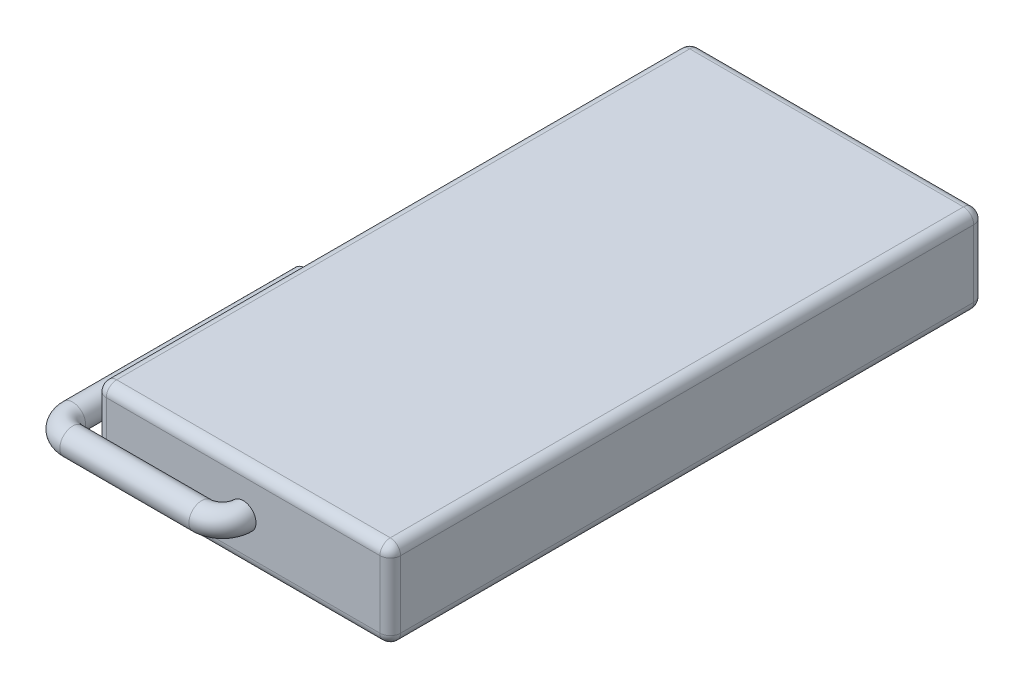
ISO-10303-21;
HEADER;
FILE_DESCRIPTION(('STEP AP214'),'2;1');
FILE_NAME('part.step','',(''),(''),'','','');
FILE_SCHEMA(('AUTOMOTIVE_DESIGN { 1 0 10303 214 1 1 1 1 }'));
ENDSEC;
DATA;
#1=APPLICATION_CONTEXT('core data for automotive mechanical design processes');
#2=APPLICATION_PROTOCOL_DEFINITION('international standard','automotive_design',2000,#1);
#3=PRODUCT_CONTEXT('',#1,'mechanical');
#4=PRODUCT('Part','Part','',(#3));
#5=PRODUCT_RELATED_PRODUCT_CATEGORY('part','',(#4));
#6=PRODUCT_DEFINITION_FORMATION('','',#4);
#7=PRODUCT_DEFINITION_CONTEXT('part definition',#1,'design');
#8=PRODUCT_DEFINITION('design','',#6,#7);
#9=PRODUCT_DEFINITION_SHAPE('','',#8);
#10=(LENGTH_UNIT() NAMED_UNIT(*) SI_UNIT(.MILLI.,.METRE.));
#11=(NAMED_UNIT(*) PLANE_ANGLE_UNIT() SI_UNIT($,.RADIAN.));
#12=(NAMED_UNIT(*) SI_UNIT($,.STERADIAN.) SOLID_ANGLE_UNIT());
#13=UNCERTAINTY_MEASURE_WITH_UNIT(LENGTH_MEASURE(1.E-05),#10,'distance_accuracy_value','');
#14=(GEOMETRIC_REPRESENTATION_CONTEXT(3) GLOBAL_UNCERTAINTY_ASSIGNED_CONTEXT((#13)) GLOBAL_UNIT_ASSIGNED_CONTEXT((#10,
#11,#12)) REPRESENTATION_CONTEXT('',''));
#15=CARTESIAN_POINT('',(0.,0.,0.));
#16=DIRECTION('',(0.,0.,1.));
#17=DIRECTION('',(1.,0.,0.));
#18=AXIS2_PLACEMENT_3D('',#15,#16,#17);
#19=CARTESIAN_POINT('',(-28.5,8.5,57.5));
#20=DIRECTION('',(1.,0.,0.));
#21=DIRECTION('',(0.,0.,-1.));
#22=AXIS2_PLACEMENT_3D('',#19,#20,#21);
#23=PLANE('',#22);
#24=DIRECTION('',(0.,0.,1.));
#25=VECTOR('',#24,1.);
#26=CARTESIAN_POINT('',(-28.5,6.5,-57.5));
#27=LINE('',#26,#25);
#28=CARTESIAN_POINT('',(-28.5,6.5,55.5));
#29=VERTEX_POINT('',#28);
#30=CARTESIAN_POINT('',(-28.5,6.5,-55.5));
#31=VERTEX_POINT('',#30);
#32=EDGE_CURVE('E199',#29,#31,#27,.F.);
#33=ORIENTED_EDGE('',*,*,#32,.T.);
#34=DIRECTION('',(0.,-1.,0.));
#35=VECTOR('',#34,1.);
#36=CARTESIAN_POINT('',(-28.5,8.5,-55.5));
#37=LINE('',#36,#35);
#38=CARTESIAN_POINT('',(-28.5,-6.5,-55.5));
#39=VERTEX_POINT('',#38);
#40=EDGE_CURVE('E201',#31,#39,#37,.T.);
#41=ORIENTED_EDGE('',*,*,#40,.T.);
#42=DIRECTION('',(0.,0.,1.));
#43=VECTOR('',#42,1.);
#44=CARTESIAN_POINT('',(-28.5,-6.5,57.5));
#45=LINE('',#44,#43);
#46=CARTESIAN_POINT('',(-28.5,-6.5,55.5));
#47=VERTEX_POINT('',#46);
#48=EDGE_CURVE('E197',#39,#47,#45,.T.);
#49=ORIENTED_EDGE('',*,*,#48,.T.);
#50=DIRECTION('',(0.,-1.,0.));
#51=VECTOR('',#50,1.);
#52=CARTESIAN_POINT('',(-28.5,8.5,55.5));
#53=LINE('',#52,#51);
#54=EDGE_CURVE('E195',#47,#29,#53,.F.);
#55=ORIENTED_EDGE('',*,*,#54,.T.);
#56=EDGE_LOOP('',(#33,#41,#49,#55));
#57=FACE_BOUND('',#56,.T.);
#58=ADVANCED_FACE('F34',(#57),#23,.F.);
#59=CARTESIAN_POINT('',(28.5,8.5,57.5));
#60=DIRECTION('',(0.,0.,-1.));
#61=DIRECTION('',(-1.,0.,0.));
#62=AXIS2_PLACEMENT_3D('',#59,#60,#61);
#63=PLANE('',#62);
#64=CARTESIAN_POINT('',(0.,0.,57.5));
#65=DIRECTION('',(0.,0.,1.));
#66=DIRECTION('',(1.,0.,0.));
#67=AXIS2_PLACEMENT_3D('',#64,#65,#66);
#68=CIRCLE('',#67,2.5);
#69=CARTESIAN_POINT('',(2.5,0.,57.5));
#70=VERTEX_POINT('',#69);
#71=EDGE_CURVE('E11',#70,#70,#68,.T.);
#72=ORIENTED_EDGE('',*,*,#71,.F.);
#73=EDGE_LOOP('',(#72));
#74=FACE_BOUND('',#73,.T.);
#75=DIRECTION('',(1.,0.,0.));
#76=VECTOR('',#75,1.);
#77=CARTESIAN_POINT('',(-28.5,6.5,57.5));
#78=LINE('',#77,#76);
#79=CARTESIAN_POINT('',(26.5,6.5,57.5));
#80=VERTEX_POINT('',#79);
#81=CARTESIAN_POINT('',(-26.5,6.5,57.5));
#82=VERTEX_POINT('',#81);
#83=EDGE_CURVE('E51',#80,#82,#78,.F.);
#84=ORIENTED_EDGE('',*,*,#83,.T.);
#85=DIRECTION('',(0.,-1.,0.));
#86=VECTOR('',#85,1.);
#87=CARTESIAN_POINT('',(-26.5,8.5,57.5));
#88=LINE('',#87,#86);
#89=CARTESIAN_POINT('',(-26.5,-6.5,57.5));
#90=VERTEX_POINT('',#89);
#91=EDGE_CURVE('E43',#82,#90,#88,.T.);
#92=ORIENTED_EDGE('',*,*,#91,.T.);
#93=DIRECTION('',(1.,0.,0.));
#94=VECTOR('',#93,1.);
#95=CARTESIAN_POINT('',(28.5,-6.5,57.5));
#96=LINE('',#95,#94);
#97=CARTESIAN_POINT('',(26.5,-6.5,57.5));
#98=VERTEX_POINT('',#97);
#99=EDGE_CURVE('E204',#90,#98,#96,.T.);
#100=ORIENTED_EDGE('',*,*,#99,.T.);
#101=DIRECTION('',(0.,-1.,0.));
#102=VECTOR('',#101,1.);
#103=CARTESIAN_POINT('',(26.5,8.5,57.5));
#104=LINE('',#103,#102);
#105=EDGE_CURVE('E56',#98,#80,#104,.F.);
#106=ORIENTED_EDGE('',*,*,#105,.T.);
#107=EDGE_LOOP('',(#84,#92,#100,#106));
#108=FACE_BOUND('',#107,.T.);
#109=ADVANCED_FACE('F292',(#74,#108),#63,.F.);
#110=CARTESIAN_POINT('',(28.5,8.5,57.5));
#111=DIRECTION('',(-1.,0.,0.));
#112=DIRECTION('',(0.,0.,1.));
#113=AXIS2_PLACEMENT_3D('',#110,#111,#112);
#114=PLANE('',#113);
#115=DIRECTION('',(0.,0.,-1.));
#116=VECTOR('',#115,1.);
#117=CARTESIAN_POINT('',(28.5,-6.5,57.5));
#118=LINE('',#117,#116);
#119=CARTESIAN_POINT('',(28.5,-6.5,55.5));
#120=VERTEX_POINT('',#119);
#121=CARTESIAN_POINT('',(28.5,-6.5,-55.5));
#122=VERTEX_POINT('',#121);
#123=EDGE_CURVE('E135',#120,#122,#118,.T.);
#124=ORIENTED_EDGE('',*,*,#123,.T.);
#125=DIRECTION('',(0.,-1.,0.));
#126=VECTOR('',#125,1.);
#127=CARTESIAN_POINT('',(28.5,8.5,-55.5));
#128=LINE('',#127,#126);
#129=CARTESIAN_POINT('',(28.5,6.5,-55.5));
#130=VERTEX_POINT('',#129);
#131=EDGE_CURVE('E131',#122,#130,#128,.F.);
#132=ORIENTED_EDGE('',*,*,#131,.T.);
#133=DIRECTION('',(0.,0.,-1.));
#134=VECTOR('',#133,1.);
#135=CARTESIAN_POINT('',(28.5,6.5,57.5));
#136=LINE('',#135,#134);
#137=CARTESIAN_POINT('',(28.5,6.5,55.5));
#138=VERTEX_POINT('',#137);
#139=EDGE_CURVE('E123',#130,#138,#136,.F.);
#140=ORIENTED_EDGE('',*,*,#139,.T.);
#141=DIRECTION('',(0.,-1.,0.));
#142=VECTOR('',#141,1.);
#143=CARTESIAN_POINT('',(28.5,8.5,55.5));
#144=LINE('',#143,#142);
#145=EDGE_CURVE('E128',#138,#120,#144,.T.);
#146=ORIENTED_EDGE('',*,*,#145,.T.);
#147=EDGE_LOOP('',(#124,#132,#140,#146));
#148=FACE_BOUND('',#147,.T.);
#149=ADVANCED_FACE('F126',(#148),#114,.F.);
#150=CARTESIAN_POINT('',(28.5,8.5,-57.5));
#151=DIRECTION('',(0.,0.,1.));
#152=DIRECTION('',(1.,0.,0.));
#153=AXIS2_PLACEMENT_3D('',#150,#151,#152);
#154=PLANE('',#153);
#155=DIRECTION('',(-1.,0.,0.));
#156=VECTOR('',#155,1.);
#157=CARTESIAN_POINT('',(28.5,6.5,-57.5));
#158=LINE('',#157,#156);
#159=CARTESIAN_POINT('',(-26.5,6.5,-57.5));
#160=VERTEX_POINT('',#159);
#161=CARTESIAN_POINT('',(26.5,6.5,-57.5));
#162=VERTEX_POINT('',#161);
#163=EDGE_CURVE('E190',#160,#162,#158,.F.);
#164=ORIENTED_EDGE('',*,*,#163,.T.);
#165=DIRECTION('',(0.,-1.,0.));
#166=VECTOR('',#165,1.);
#167=CARTESIAN_POINT('',(26.5,8.5,-57.5));
#168=LINE('',#167,#166);
#169=CARTESIAN_POINT('',(26.5,-6.5,-57.5));
#170=VERTEX_POINT('',#169);
#171=EDGE_CURVE('E192',#162,#170,#168,.T.);
#172=ORIENTED_EDGE('',*,*,#171,.T.);
#173=DIRECTION('',(-1.,0.,0.));
#174=VECTOR('',#173,1.);
#175=CARTESIAN_POINT('',(28.5,-6.5,-57.5));
#176=LINE('',#175,#174);
#177=CARTESIAN_POINT('',(-26.5,-6.5,-57.5));
#178=VERTEX_POINT('',#177);
#179=EDGE_CURVE('E188',#170,#178,#176,.T.);
#180=ORIENTED_EDGE('',*,*,#179,.T.);
#181=DIRECTION('',(0.,-1.,0.));
#182=VECTOR('',#181,1.);
#183=CARTESIAN_POINT('',(-26.5,8.5,-57.5));
#184=LINE('',#183,#182);
#185=EDGE_CURVE('E186',#178,#160,#184,.F.);
#186=ORIENTED_EDGE('',*,*,#185,.T.);
#187=EDGE_LOOP('',(#164,#172,#180,#186));
#188=FACE_BOUND('',#187,.T.);
#189=ADVANCED_FACE('F271',(#188),#154,.F.);
#190=CARTESIAN_POINT('',(0.,8.5,0.));
#191=DIRECTION('',(0.,1.,0.));
#192=DIRECTION('',(0.,0.,1.));
#193=AXIS2_PLACEMENT_3D('',#190,#191,#192);
#194=PLANE('',#193);
#195=DIRECTION('',(1.,0.,0.));
#196=VECTOR('',#195,1.);
#197=CARTESIAN_POINT('',(28.5,8.5,55.5));
#198=LINE('',#197,#196);
#199=CARTESIAN_POINT('',(-26.5,8.5,55.5));
#200=VERTEX_POINT('',#199);
#201=CARTESIAN_POINT('',(26.5,8.5,55.5));
#202=VERTEX_POINT('',#201);
#203=EDGE_CURVE('E179',#200,#202,#198,.T.);
#204=ORIENTED_EDGE('',*,*,#203,.T.);
#205=DIRECTION('',(0.,0.,-1.));
#206=VECTOR('',#205,1.);
#207=CARTESIAN_POINT('',(26.5,8.5,-57.5));
#208=LINE('',#207,#206);
#209=CARTESIAN_POINT('',(26.5,8.5,-55.5));
#210=VERTEX_POINT('',#209);
#211=EDGE_CURVE('E143',#202,#210,#208,.T.);
#212=ORIENTED_EDGE('',*,*,#211,.T.);
#213=DIRECTION('',(-1.,0.,0.));
#214=VECTOR('',#213,1.);
#215=CARTESIAN_POINT('',(-28.5,8.5,-55.5));
#216=LINE('',#215,#214);
#217=CARTESIAN_POINT('',(-26.5,8.5,-55.5));
#218=VERTEX_POINT('',#217);
#219=EDGE_CURVE('E183',#210,#218,#216,.T.);
#220=ORIENTED_EDGE('',*,*,#219,.T.);
#221=DIRECTION('',(0.,0.,1.));
#222=VECTOR('',#221,1.);
#223=CARTESIAN_POINT('',(-26.5,8.5,57.5));
#224=LINE('',#223,#222);
#225=EDGE_CURVE('E181',#218,#200,#224,.T.);
#226=ORIENTED_EDGE('',*,*,#225,.T.);
#227=EDGE_LOOP('',(#204,#212,#220,#226));
#228=FACE_BOUND('',#227,.T.);
#229=ADVANCED_FACE('F536',(#228),#194,.T.);
#230=CARTESIAN_POINT('',(0.,-8.5,0.));
#231=DIRECTION('',(0.,1.,0.));
#232=DIRECTION('',(0.,0.,1.));
#233=AXIS2_PLACEMENT_3D('',#230,#231,#232);
#234=PLANE('',#233);
#235=DIRECTION('',(-1.,0.,0.));
#236=VECTOR('',#235,1.);
#237=CARTESIAN_POINT('',(0.,-8.5,-55.5));
#238=LINE('',#237,#236);
#239=CARTESIAN_POINT('',(-26.5,-8.5,-55.5));
#240=VERTEX_POINT('',#239);
#241=CARTESIAN_POINT('',(26.5,-8.5,-55.5));
#242=VERTEX_POINT('',#241);
#243=EDGE_CURVE('E174',#240,#242,#238,.F.);
#244=ORIENTED_EDGE('',*,*,#243,.T.);
#245=DIRECTION('',(0.,0.,-1.));
#246=VECTOR('',#245,1.);
#247=CARTESIAN_POINT('',(26.5,-8.5,0.));
#248=LINE('',#247,#246);
#249=CARTESIAN_POINT('',(26.5,-8.5,55.5));
#250=VERTEX_POINT('',#249);
#251=EDGE_CURVE('E176',#242,#250,#248,.F.);
#252=ORIENTED_EDGE('',*,*,#251,.T.);
#253=DIRECTION('',(1.,0.,0.));
#254=VECTOR('',#253,1.);
#255=CARTESIAN_POINT('',(0.,-8.5,55.5));
#256=LINE('',#255,#254);
#257=CARTESIAN_POINT('',(-26.5,-8.5,55.5));
#258=VERTEX_POINT('',#257);
#259=EDGE_CURVE('E170',#250,#258,#256,.F.);
#260=ORIENTED_EDGE('',*,*,#259,.T.);
#261=DIRECTION('',(0.,0.,1.));
#262=VECTOR('',#261,1.);
#263=CARTESIAN_POINT('',(-26.5,-8.5,0.));
#264=LINE('',#263,#262);
#265=EDGE_CURVE('E172',#258,#240,#264,.F.);
#266=ORIENTED_EDGE('',*,*,#265,.T.);
#267=EDGE_LOOP('',(#244,#252,#260,#266));
#268=FACE_BOUND('',#267,.T.);
#269=ADVANCED_FACE('F529',(#268),#234,.F.);
#270=CARTESIAN_POINT('',(-26.5,6.5,0.));
#271=DIRECTION('',(0.,0.,-1.));
#272=DIRECTION('',(-1.,0.,0.));
#273=AXIS2_PLACEMENT_3D('',#270,#271,#272);
#274=CYLINDRICAL_SURFACE('',#273,2.);
#275=CARTESIAN_POINT('',(-26.5,6.5,55.5));
#276=DIRECTION('',(0.,0.,1.));
#277=DIRECTION('',(1.,0.,0.));
#278=AXIS2_PLACEMENT_3D('',#275,#276,#277);
#279=CIRCLE('',#278,2.);
#280=EDGE_CURVE('E38',#200,#29,#279,.T.);
#281=ORIENTED_EDGE('',*,*,#280,.F.);
#282=ORIENTED_EDGE('',*,*,#225,.F.);
#283=CARTESIAN_POINT('',(-26.5,6.5,-55.5));
#284=DIRECTION('',(0.,0.,-1.));
#285=DIRECTION('',(0.,1.,0.));
#286=AXIS2_PLACEMENT_3D('',#283,#284,#285);
#287=CIRCLE('',#286,2.);
#288=EDGE_CURVE('E163',#31,#218,#287,.T.);
#289=ORIENTED_EDGE('',*,*,#288,.F.);
#290=ORIENTED_EDGE('',*,*,#32,.F.);
#291=EDGE_LOOP('',(#281,#282,#289,#290));
#292=FACE_BOUND('',#291,.T.);
#293=ADVANCED_FACE('F36',(#292),#274,.T.);
#294=CARTESIAN_POINT('',(-26.5,6.5,55.5));
#295=DIRECTION('',(0.,0.,1.));
#296=DIRECTION('',(1.,0.,0.));
#297=AXIS2_PLACEMENT_3D('',#294,#295,#296);
#298=SPHERICAL_SURFACE('',#297,2.);
#299=CARTESIAN_POINT('',(-26.5,6.5,55.5));
#300=DIRECTION('',(-1.,0.,0.));
#301=DIRECTION('',(0.,0.,1.));
#302=AXIS2_PLACEMENT_3D('',#299,#300,#301);
#303=CIRCLE('',#302,2.);
#304=EDGE_CURVE('E250',#200,#82,#303,.F.);
#305=ORIENTED_EDGE('',*,*,#304,.F.);
#306=ORIENTED_EDGE('',*,*,#280,.T.);
#307=CARTESIAN_POINT('',(-26.5,6.5,55.5));
#308=DIRECTION('',(0.,1.,0.));
#309=DIRECTION('',(0.,0.,1.));
#310=AXIS2_PLACEMENT_3D('',#307,#308,#309);
#311=CIRCLE('',#310,2.);
#312=EDGE_CURVE('E252',#82,#29,#311,.F.);
#313=ORIENTED_EDGE('',*,*,#312,.F.);
#314=EDGE_LOOP('',(#305,#306,#313));
#315=FACE_BOUND('',#314,.T.);
#316=ADVANCED_FACE('F285',(#315),#298,.T.);
#317=CARTESIAN_POINT('',(-26.5,6.5,-55.5));
#318=DIRECTION('',(0.,0.,1.));
#319=DIRECTION('',(1.,0.,0.));
#320=AXIS2_PLACEMENT_3D('',#317,#318,#319);
#321=SPHERICAL_SURFACE('',#320,2.);
#322=CARTESIAN_POINT('',(-26.5,6.5,-55.5));
#323=DIRECTION('',(0.,1.,0.));
#324=DIRECTION('',(0.,0.,1.));
#325=AXIS2_PLACEMENT_3D('',#322,#323,#324);
#326=CIRCLE('',#325,2.);
#327=EDGE_CURVE('E244',#31,#160,#326,.F.);
#328=ORIENTED_EDGE('',*,*,#327,.F.);
#329=ORIENTED_EDGE('',*,*,#288,.T.);
#330=CARTESIAN_POINT('',(-26.5,6.5,-55.5));
#331=DIRECTION('',(-1.,0.,0.));
#332=DIRECTION('',(0.,0.,1.));
#333=AXIS2_PLACEMENT_3D('',#330,#331,#332);
#334=CIRCLE('',#333,2.);
#335=EDGE_CURVE('E247',#160,#218,#334,.F.);
#336=ORIENTED_EDGE('',*,*,#335,.F.);
#337=EDGE_LOOP('',(#328,#329,#336));
#338=FACE_BOUND('',#337,.T.);
#339=ADVANCED_FACE('F259',(#338),#321,.T.);
#340=CARTESIAN_POINT('',(-26.5,8.5,55.5));
#341=DIRECTION('',(0.,-1.,0.));
#342=DIRECTION('',(0.,0.,-1.));
#343=AXIS2_PLACEMENT_3D('',#340,#341,#342);
#344=CYLINDRICAL_SURFACE('',#343,2.);
#345=ORIENTED_EDGE('',*,*,#312,.T.);
#346=ORIENTED_EDGE('',*,*,#54,.F.);
#347=CARTESIAN_POINT('',(-26.5,-6.5,55.5));
#348=DIRECTION('',(0.,-1.,0.));
#349=DIRECTION('',(0.,0.,-1.));
#350=AXIS2_PLACEMENT_3D('',#347,#348,#349);
#351=CIRCLE('',#350,2.);
#352=EDGE_CURVE('E238',#90,#47,#351,.T.);
#353=ORIENTED_EDGE('',*,*,#352,.F.);
#354=ORIENTED_EDGE('',*,*,#91,.F.);
#355=EDGE_LOOP('',(#345,#346,#353,#354));
#356=FACE_BOUND('',#355,.T.);
#357=ADVANCED_FACE('F289',(#356),#344,.T.);
#358=CARTESIAN_POINT('',(0.,6.5,55.5));
#359=DIRECTION('',(-1.,0.,0.));
#360=DIRECTION('',(0.,0.,1.));
#361=AXIS2_PLACEMENT_3D('',#358,#359,#360);
#362=CYLINDRICAL_SURFACE('',#361,2.);
#363=ORIENTED_EDGE('',*,*,#304,.T.);
#364=ORIENTED_EDGE('',*,*,#83,.F.);
#365=CARTESIAN_POINT('',(26.5,6.5,55.5));
#366=DIRECTION('',(1.,0.,0.));
#367=DIRECTION('',(0.,0.,-1.));
#368=AXIS2_PLACEMENT_3D('',#365,#366,#367);
#369=CIRCLE('',#368,2.);
#370=EDGE_CURVE('E147',#202,#80,#369,.T.);
#371=ORIENTED_EDGE('',*,*,#370,.F.);
#372=ORIENTED_EDGE('',*,*,#203,.F.);
#373=EDGE_LOOP('',(#363,#364,#371,#372));
#374=FACE_BOUND('',#373,.T.);
#375=ADVANCED_FACE('F493',(#374),#362,.T.);
#376=CARTESIAN_POINT('',(26.5,6.5,0.));
#377=DIRECTION('',(0.,0.,1.));
#378=DIRECTION('',(1.,0.,0.));
#379=AXIS2_PLACEMENT_3D('',#376,#377,#378);
#380=CYLINDRICAL_SURFACE('',#379,2.);
#381=CARTESIAN_POINT('',(26.5,6.5,-55.5));
#382=DIRECTION('',(0.,0.,-1.));
#383=DIRECTION('',(-1.,0.,0.));
#384=AXIS2_PLACEMENT_3D('',#381,#382,#383);
#385=CIRCLE('',#384,2.);
#386=EDGE_CURVE('E148',#210,#130,#385,.T.);
#387=ORIENTED_EDGE('',*,*,#386,.F.);
#388=ORIENTED_EDGE('',*,*,#211,.F.);
#389=CARTESIAN_POINT('',(26.5,6.5,55.5));
#390=DIRECTION('',(0.,0.,1.));
#391=DIRECTION('',(1.,0.,0.));
#392=AXIS2_PLACEMENT_3D('',#389,#390,#391);
#393=CIRCLE('',#392,2.);
#394=EDGE_CURVE('E139',#138,#202,#393,.T.);
#395=ORIENTED_EDGE('',*,*,#394,.F.);
#396=ORIENTED_EDGE('',*,*,#139,.F.);
#397=EDGE_LOOP('',(#387,#388,#395,#396));
#398=FACE_BOUND('',#397,.T.);
#399=ADVANCED_FACE('F141',(#398),#380,.T.);
#400=CARTESIAN_POINT('',(0.,6.5,-55.5));
#401=DIRECTION('',(1.,0.,0.));
#402=DIRECTION('',(0.,0.,-1.));
#403=AXIS2_PLACEMENT_3D('',#400,#401,#402);
#404=CYLINDRICAL_SURFACE('',#403,2.);
#405=ORIENTED_EDGE('',*,*,#335,.T.);
#406=ORIENTED_EDGE('',*,*,#219,.F.);
#407=CARTESIAN_POINT('',(26.5,6.5,-55.5));
#408=DIRECTION('',(1.,0.,0.));
#409=DIRECTION('',(0.,0.,-1.));
#410=AXIS2_PLACEMENT_3D('',#407,#408,#409);
#411=CIRCLE('',#410,2.);
#412=EDGE_CURVE('E234',#162,#210,#411,.T.);
#413=ORIENTED_EDGE('',*,*,#412,.F.);
#414=ORIENTED_EDGE('',*,*,#163,.F.);
#415=EDGE_LOOP('',(#405,#406,#413,#414));
#416=FACE_BOUND('',#415,.T.);
#417=ADVANCED_FACE('F267',(#416),#404,.T.);
#418=CARTESIAN_POINT('',(-26.5,8.5,-55.5));
#419=DIRECTION('',(0.,-1.,0.));
#420=DIRECTION('',(0.,0.,-1.));
#421=AXIS2_PLACEMENT_3D('',#418,#419,#420);
#422=CYLINDRICAL_SURFACE('',#421,2.);
#423=ORIENTED_EDGE('',*,*,#327,.T.);
#424=ORIENTED_EDGE('',*,*,#185,.F.);
#425=CARTESIAN_POINT('',(-26.5,-6.5,-55.5));
#426=DIRECTION('',(0.,-1.,0.));
#427=DIRECTION('',(0.,0.,-1.));
#428=AXIS2_PLACEMENT_3D('',#425,#426,#427);
#429=CIRCLE('',#428,2.);
#430=EDGE_CURVE('E231',#39,#178,#429,.T.);
#431=ORIENTED_EDGE('',*,*,#430,.F.);
#432=ORIENTED_EDGE('',*,*,#40,.F.);
#433=EDGE_LOOP('',(#423,#424,#431,#432));
#434=FACE_BOUND('',#433,.T.);
#435=ADVANCED_FACE('F277',(#434),#422,.T.);
#436=CARTESIAN_POINT('',(-26.5,-6.5,57.5));
#437=DIRECTION('',(0.,0.,1.));
#438=DIRECTION('',(1.,0.,0.));
#439=AXIS2_PLACEMENT_3D('',#436,#437,#438);
#440=CYLINDRICAL_SURFACE('',#439,2.);
#441=CARTESIAN_POINT('',(-26.5,-6.5,55.5));
#442=DIRECTION('',(0.,0.,1.));
#443=DIRECTION('',(1.,0.,0.));
#444=AXIS2_PLACEMENT_3D('',#441,#442,#443);
#445=CIRCLE('',#444,2.);
#446=EDGE_CURVE('E241',#47,#258,#445,.T.);
#447=ORIENTED_EDGE('',*,*,#446,.F.);
#448=ORIENTED_EDGE('',*,*,#48,.F.);
#449=CARTESIAN_POINT('',(-26.5,-6.5,-55.5));
#450=DIRECTION('',(0.,0.,-1.));
#451=DIRECTION('',(-1.,0.,0.));
#452=AXIS2_PLACEMENT_3D('',#449,#450,#451);
#453=CIRCLE('',#452,2.);
#454=EDGE_CURVE('E229',#240,#39,#453,.T.);
#455=ORIENTED_EDGE('',*,*,#454,.F.);
#456=ORIENTED_EDGE('',*,*,#265,.F.);
#457=EDGE_LOOP('',(#447,#448,#455,#456));
#458=FACE_BOUND('',#457,.T.);
#459=ADVANCED_FACE('F462',(#458),#440,.T.);
#460=CARTESIAN_POINT('',(-26.5,-6.5,55.5));
#461=DIRECTION('',(0.,0.,1.));
#462=DIRECTION('',(1.,0.,0.));
#463=AXIS2_PLACEMENT_3D('',#460,#461,#462);
#464=SPHERICAL_SURFACE('',#463,2.);
#465=ORIENTED_EDGE('',*,*,#352,.T.);
#466=ORIENTED_EDGE('',*,*,#446,.T.);
#467=CARTESIAN_POINT('',(-26.5,-6.5,55.5));
#468=DIRECTION('',(-1.,0.,0.));
#469=DIRECTION('',(0.,0.,1.));
#470=AXIS2_PLACEMENT_3D('',#467,#468,#469);
#471=CIRCLE('',#470,2.);
#472=EDGE_CURVE('E154',#90,#258,#471,.F.);
#473=ORIENTED_EDGE('',*,*,#472,.F.);
#474=EDGE_LOOP('',(#465,#466,#473));
#475=FACE_BOUND('',#474,.T.);
#476=ADVANCED_FACE('F322',(#475),#464,.T.);
#477=CARTESIAN_POINT('',(26.5,6.5,55.5));
#478=DIRECTION('',(0.,0.,1.));
#479=DIRECTION('',(1.,0.,0.));
#480=AXIS2_PLACEMENT_3D('',#477,#478,#479);
#481=SPHERICAL_SURFACE('',#480,2.);
#482=ORIENTED_EDGE('',*,*,#394,.T.);
#483=ORIENTED_EDGE('',*,*,#370,.T.);
#484=CARTESIAN_POINT('',(26.5,6.5,55.5));
#485=DIRECTION('',(0.,1.,0.));
#486=DIRECTION('',(0.,0.,1.));
#487=AXIS2_PLACEMENT_3D('',#484,#485,#486);
#488=CIRCLE('',#487,2.);
#489=EDGE_CURVE('E151',#138,#80,#488,.F.);
#490=ORIENTED_EDGE('',*,*,#489,.F.);
#491=EDGE_LOOP('',(#482,#483,#490));
#492=FACE_BOUND('',#491,.T.);
#493=ADVANCED_FACE('F152',(#492),#481,.T.);
#494=CARTESIAN_POINT('',(26.5,6.5,-55.5));
#495=DIRECTION('',(0.,0.,1.));
#496=DIRECTION('',(1.,0.,0.));
#497=AXIS2_PLACEMENT_3D('',#494,#495,#496);
#498=SPHERICAL_SURFACE('',#497,2.);
#499=ORIENTED_EDGE('',*,*,#412,.T.);
#500=ORIENTED_EDGE('',*,*,#386,.T.);
#501=CARTESIAN_POINT('',(26.5,6.5,-55.5));
#502=DIRECTION('',(0.,1.,0.));
#503=DIRECTION('',(0.,0.,1.));
#504=AXIS2_PLACEMENT_3D('',#501,#502,#503);
#505=CIRCLE('',#504,2.);
#506=EDGE_CURVE('E155',#162,#130,#505,.F.);
#507=ORIENTED_EDGE('',*,*,#506,.F.);
#508=EDGE_LOOP('',(#499,#500,#507));
#509=FACE_BOUND('',#508,.T.);
#510=ADVANCED_FACE('F312',(#509),#498,.T.);
#511=CARTESIAN_POINT('',(-26.5,-6.5,-55.5));
#512=DIRECTION('',(0.,0.,1.));
#513=DIRECTION('',(1.,0.,0.));
#514=AXIS2_PLACEMENT_3D('',#511,#512,#513);
#515=SPHERICAL_SURFACE('',#514,2.);
#516=ORIENTED_EDGE('',*,*,#454,.T.);
#517=ORIENTED_EDGE('',*,*,#430,.T.);
#518=CARTESIAN_POINT('',(-26.5,-6.5,-55.5));
#519=DIRECTION('',(-1.,0.,0.));
#520=DIRECTION('',(0.,0.,1.));
#521=AXIS2_PLACEMENT_3D('',#518,#519,#520);
#522=CIRCLE('',#521,2.);
#523=EDGE_CURVE('E222',#240,#178,#522,.F.);
#524=ORIENTED_EDGE('',*,*,#523,.F.);
#525=EDGE_LOOP('',(#516,#517,#524));
#526=FACE_BOUND('',#525,.T.);
#527=ADVANCED_FACE('F314',(#526),#515,.T.);
#528=CARTESIAN_POINT('',(28.5,-6.5,55.5));
#529=DIRECTION('',(1.,0.,0.));
#530=DIRECTION('',(0.,0.,-1.));
#531=AXIS2_PLACEMENT_3D('',#528,#529,#530);
#532=CYLINDRICAL_SURFACE('',#531,2.);
#533=ORIENTED_EDGE('',*,*,#472,.T.);
#534=ORIENTED_EDGE('',*,*,#259,.F.);
#535=CARTESIAN_POINT('',(26.5,-6.5,55.5));
#536=DIRECTION('',(1.,0.,0.));
#537=DIRECTION('',(0.,0.,-1.));
#538=AXIS2_PLACEMENT_3D('',#535,#536,#537);
#539=CIRCLE('',#538,2.);
#540=EDGE_CURVE('E219',#98,#250,#539,.T.);
#541=ORIENTED_EDGE('',*,*,#540,.F.);
#542=ORIENTED_EDGE('',*,*,#99,.F.);
#543=EDGE_LOOP('',(#533,#534,#541,#542));
#544=FACE_BOUND('',#543,.T.);
#545=ADVANCED_FACE('F297',(#544),#532,.T.);
#546=CARTESIAN_POINT('',(26.5,8.5,55.5));
#547=DIRECTION('',(0.,-1.,0.));
#548=DIRECTION('',(0.,0.,-1.));
#549=AXIS2_PLACEMENT_3D('',#546,#547,#548);
#550=CYLINDRICAL_SURFACE('',#549,2.);
#551=ORIENTED_EDGE('',*,*,#489,.T.);
#552=ORIENTED_EDGE('',*,*,#105,.F.);
#553=CARTESIAN_POINT('',(26.5,-6.5,55.5));
#554=DIRECTION('',(0.,-1.,0.));
#555=DIRECTION('',(0.,0.,-1.));
#556=AXIS2_PLACEMENT_3D('',#553,#554,#555);
#557=CIRCLE('',#556,2.);
#558=EDGE_CURVE('E159',#120,#98,#557,.T.);
#559=ORIENTED_EDGE('',*,*,#558,.F.);
#560=ORIENTED_EDGE('',*,*,#145,.F.);
#561=EDGE_LOOP('',(#551,#552,#559,#560));
#562=FACE_BOUND('',#561,.T.);
#563=ADVANCED_FACE('F157',(#562),#550,.T.);
#564=CARTESIAN_POINT('',(26.5,8.5,-55.5));
#565=DIRECTION('',(0.,-1.,0.));
#566=DIRECTION('',(0.,0.,-1.));
#567=AXIS2_PLACEMENT_3D('',#564,#565,#566);
#568=CYLINDRICAL_SURFACE('',#567,2.);
#569=ORIENTED_EDGE('',*,*,#506,.T.);
#570=ORIENTED_EDGE('',*,*,#131,.F.);
#571=CARTESIAN_POINT('',(26.5,-6.5,-55.5));
#572=DIRECTION('',(0.,-1.,0.));
#573=DIRECTION('',(0.,0.,-1.));
#574=AXIS2_PLACEMENT_3D('',#571,#572,#573);
#575=CIRCLE('',#574,2.);
#576=EDGE_CURVE('E215',#170,#122,#575,.T.);
#577=ORIENTED_EDGE('',*,*,#576,.F.);
#578=ORIENTED_EDGE('',*,*,#171,.F.);
#579=EDGE_LOOP('',(#569,#570,#577,#578));
#580=FACE_BOUND('',#579,.T.);
#581=ADVANCED_FACE('F310',(#580),#568,.T.);
#582=CARTESIAN_POINT('',(28.5,-6.5,-55.5));
#583=DIRECTION('',(-1.,0.,0.));
#584=DIRECTION('',(0.,0.,1.));
#585=AXIS2_PLACEMENT_3D('',#582,#583,#584);
#586=CYLINDRICAL_SURFACE('',#585,2.);
#587=ORIENTED_EDGE('',*,*,#523,.T.);
#588=ORIENTED_EDGE('',*,*,#179,.F.);
#589=CARTESIAN_POINT('',(26.5,-6.5,-55.5));
#590=DIRECTION('',(1.,0.,0.));
#591=DIRECTION('',(0.,0.,-1.));
#592=AXIS2_PLACEMENT_3D('',#589,#590,#591);
#593=CIRCLE('',#592,2.);
#594=EDGE_CURVE('E213',#242,#170,#593,.T.);
#595=ORIENTED_EDGE('',*,*,#594,.F.);
#596=ORIENTED_EDGE('',*,*,#243,.F.);
#597=EDGE_LOOP('',(#587,#588,#595,#596));
#598=FACE_BOUND('',#597,.T.);
#599=ADVANCED_FACE('F341',(#598),#586,.T.);
#600=CARTESIAN_POINT('',(26.5,-6.5,55.5));
#601=DIRECTION('',(0.,0.,1.));
#602=DIRECTION('',(1.,0.,0.));
#603=AXIS2_PLACEMENT_3D('',#600,#601,#602);
#604=SPHERICAL_SURFACE('',#603,2.);
#605=ORIENTED_EDGE('',*,*,#558,.T.);
#606=ORIENTED_EDGE('',*,*,#540,.T.);
#607=CARTESIAN_POINT('',(26.5,-6.5,55.5));
#608=DIRECTION('',(0.,0.,1.));
#609=DIRECTION('',(1.,0.,0.));
#610=AXIS2_PLACEMENT_3D('',#607,#608,#609);
#611=CIRCLE('',#610,2.);
#612=EDGE_CURVE('E211',#120,#250,#611,.F.);
#613=ORIENTED_EDGE('',*,*,#612,.F.);
#614=EDGE_LOOP('',(#605,#606,#613));
#615=FACE_BOUND('',#614,.T.);
#616=ADVANCED_FACE('F299',(#615),#604,.T.);
#617=CARTESIAN_POINT('',(26.5,-6.5,-55.5));
#618=DIRECTION('',(0.,0.,1.));
#619=DIRECTION('',(1.,0.,0.));
#620=AXIS2_PLACEMENT_3D('',#617,#618,#619);
#621=SPHERICAL_SURFACE('',#620,2.);
#622=ORIENTED_EDGE('',*,*,#594,.T.);
#623=ORIENTED_EDGE('',*,*,#576,.T.);
#624=CARTESIAN_POINT('',(26.5,-6.5,-55.5));
#625=DIRECTION('',(0.,0.,-1.));
#626=DIRECTION('',(-1.,0.,0.));
#627=AXIS2_PLACEMENT_3D('',#624,#625,#626);
#628=CIRCLE('',#627,2.);
#629=EDGE_CURVE('E209',#242,#122,#628,.F.);
#630=ORIENTED_EDGE('',*,*,#629,.F.);
#631=EDGE_LOOP('',(#622,#623,#630));
#632=FACE_BOUND('',#631,.T.);
#633=ADVANCED_FACE('F307',(#632),#621,.T.);
#634=CARTESIAN_POINT('',(26.5,-6.5,57.5));
#635=DIRECTION('',(0.,0.,-1.));
#636=DIRECTION('',(-1.,0.,0.));
#637=AXIS2_PLACEMENT_3D('',#634,#635,#636);
#638=CYLINDRICAL_SURFACE('',#637,2.);
#639=ORIENTED_EDGE('',*,*,#612,.T.);
#640=ORIENTED_EDGE('',*,*,#251,.F.);
#641=ORIENTED_EDGE('',*,*,#629,.T.);
#642=ORIENTED_EDGE('',*,*,#123,.F.);
#643=EDGE_LOOP('',(#639,#640,#641,#642));
#644=FACE_BOUND('',#643,.T.);
#645=ADVANCED_FACE('F303',(#644),#638,.T.);
#646=CARTESIAN_POINT('',(-33.,0.,12.5));
#647=DIRECTION('',(0.,0.,-1.));
#648=DIRECTION('',(-1.,0.,0.));
#649=AXIS2_PLACEMENT_3D('',#646,#647,#648);
#650=PLANE('',#649);
#651=CARTESIAN_POINT('',(-33.,0.,12.5));
#652=DIRECTION('',(0.,0.,-1.));
#653=DIRECTION('',(-1.,0.,0.));
#654=AXIS2_PLACEMENT_3D('',#651,#652,#653);
#655=CIRCLE('',#654,2.5);
#656=CARTESIAN_POINT('',(-35.5,0.,12.5));
#657=VERTEX_POINT('',#656);
#658=EDGE_CURVE('E165',#657,#657,#655,.T.);
#659=ORIENTED_EDGE('',*,*,#658,.T.);
#660=EDGE_LOOP('',(#659));
#661=FACE_BOUND('',#660,.T.);
#662=ADVANCED_FACE('F335',(#661),#650,.T.);
#663=CARTESIAN_POINT('',(-4.,0.,57.5));
#664=DIRECTION('',(0.,-1.,0.));
#665=DIRECTION('',(0.,0.,-1.));
#666=AXIS2_PLACEMENT_3D('',#663,#664,#665);
#667=TOROIDAL_SURFACE('',#666,4.,2.5);
#668=CARTESIAN_POINT('',(-4.,0.,61.5));
#669=DIRECTION('',(-1.,0.,0.));
#670=DIRECTION('',(0.,0.,1.));
#671=AXIS2_PLACEMENT_3D('',#668,#669,#670);
#672=CIRCLE('',#671,2.5);
#673=CARTESIAN_POINT('',(-4.00000000000001,0.,64.));
#674=VERTEX_POINT('',#673);
#675=EDGE_CURVE('E596',#674,#674,#672,.T.);
#676=CARTESIAN_POINT('',(-4.,0.,57.5));
#677=DIRECTION('',(0.,-1.,0.));
#678=DIRECTION('',(0.,0.,-1.));
#679=AXIS2_PLACEMENT_3D('',#676,#677,#678);
#680=CIRCLE('',#679,6.5);
#681=EDGE_CURVE('',#70,#674,#680,.T.);
#682=ORIENTED_EDGE('',*,*,#71,.T.);
#683=ORIENTED_EDGE('',*,*,#675,.F.);
#684=ORIENTED_EDGE('',*,*,#681,.T.);
#685=ORIENTED_EDGE('',*,*,#681,.F.);
#686=EDGE_LOOP('',(#682,#684,#683,#685));
#687=FACE_BOUND('',#686,.T.);
#688=ADVANCED_FACE('F385',(#687),#667,.T.);
#689=CARTESIAN_POINT('',(-4.,0.,61.5));
#690=DIRECTION('',(-1.,0.,0.));
#691=DIRECTION('',(0.,0.,1.));
#692=AXIS2_PLACEMENT_3D('',#689,#690,#691);
#693=CYLINDRICAL_SURFACE('',#692,2.5);
#694=CARTESIAN_POINT('',(-29.,0.,61.5));
#695=DIRECTION('',(-1.,0.,0.));
#696=DIRECTION('',(0.,0.,1.));
#697=AXIS2_PLACEMENT_3D('',#694,#695,#696);
#698=CIRCLE('',#697,2.5);
#699=CARTESIAN_POINT('',(-29.,0.,64.));
#700=VERTEX_POINT('',#699);
#701=EDGE_CURVE('E594',#700,#700,#698,.T.);
#702=ORIENTED_EDGE('',*,*,#701,.F.);
#703=EDGE_LOOP('',(#702));
#704=FACE_BOUND('',#703,.T.);
#705=ORIENTED_EDGE('',*,*,#675,.T.);
#706=EDGE_LOOP('',(#705));
#707=FACE_BOUND('',#706,.T.);
#708=ADVANCED_FACE('F393',(#704,#707),#693,.T.);
#709=CARTESIAN_POINT('',(-29.,0.,57.5));
#710=DIRECTION('',(0.,-1.,0.));
#711=DIRECTION('',(0.,0.,-1.));
#712=AXIS2_PLACEMENT_3D('',#709,#710,#711);
#713=TOROIDAL_SURFACE('',#712,4.,2.5);
#714=CARTESIAN_POINT('',(-33.,0.,57.5));
#715=DIRECTION('',(0.,0.,-1.));
#716=DIRECTION('',(-1.,0.,0.));
#717=AXIS2_PLACEMENT_3D('',#714,#715,#716);
#718=CIRCLE('',#717,2.5);
#719=CARTESIAN_POINT('',(-35.5,0.,57.5));
#720=VERTEX_POINT('',#719);
#721=EDGE_CURVE('E593',#720,#720,#718,.T.);
#722=CARTESIAN_POINT('',(-29.,0.,57.5));
#723=DIRECTION('',(0.,-1.,0.));
#724=DIRECTION('',(0.,0.,-1.));
#725=AXIS2_PLACEMENT_3D('',#722,#723,#724);
#726=CIRCLE('',#725,6.5);
#727=EDGE_CURVE('',#700,#720,#726,.T.);
#728=ORIENTED_EDGE('',*,*,#701,.T.);
#729=ORIENTED_EDGE('',*,*,#721,.F.);
#730=ORIENTED_EDGE('',*,*,#727,.T.);
#731=ORIENTED_EDGE('',*,*,#727,.F.);
#732=EDGE_LOOP('',(#728,#730,#729,#731));
#733=FACE_BOUND('',#732,.T.);
#734=ADVANCED_FACE('F401',(#733),#713,.T.);
#735=CARTESIAN_POINT('',(-33.,0.,57.5));
#736=DIRECTION('',(0.,0.,-1.));
#737=DIRECTION('',(-1.,0.,0.));
#738=AXIS2_PLACEMENT_3D('',#735,#736,#737);
#739=CYLINDRICAL_SURFACE('',#738,2.5);
#740=ORIENTED_EDGE('',*,*,#658,.F.);
#741=EDGE_LOOP('',(#740));
#742=FACE_BOUND('',#741,.T.);
#743=ORIENTED_EDGE('',*,*,#721,.T.);
#744=EDGE_LOOP('',(#743));
#745=FACE_BOUND('',#744,.T.);
#746=ADVANCED_FACE('F336',(#742,#745),#739,.T.);
#747=CLOSED_SHELL('',(#58,#109,#149,#189,#229,#269,#293,#316,#339,#357,#375,#399,#417,#435,#459,
#476,#493,#510,#527,#545,#563,#581,#599,#616,#633,#645,#662,#688,#708,#734,#746));
#748=MANIFOLD_SOLID_BREP('B2',#747);
#749=ADVANCED_BREP_SHAPE_REPRESENTATION('',(#18,#748),#14);
#750=SHAPE_DEFINITION_REPRESENTATION(#9,#749);
ENDSEC;
END-ISO-10303-21;
